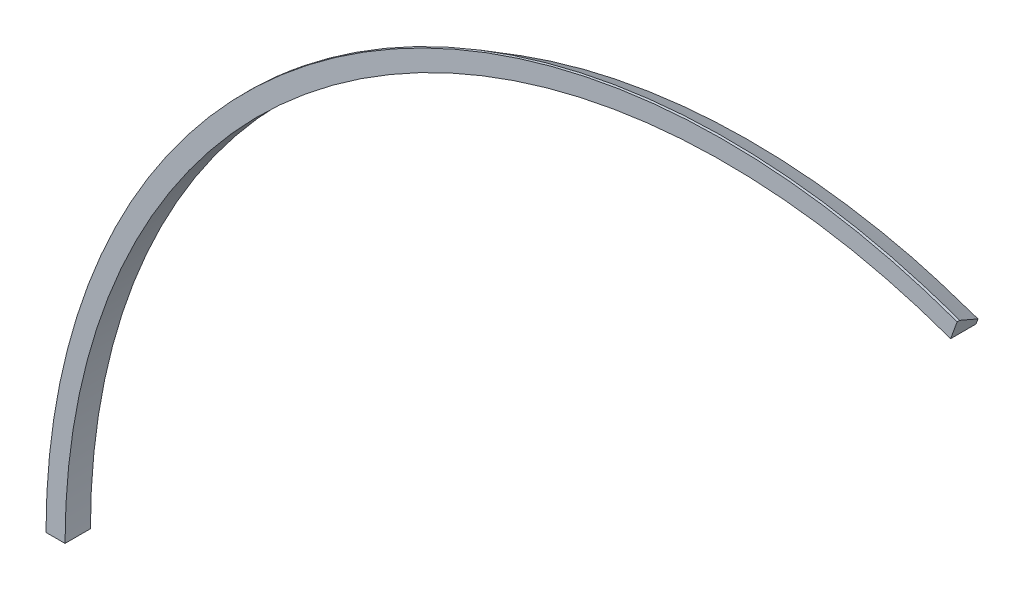
ISO-10303-21;
HEADER;
FILE_DESCRIPTION(('STEP AP214'),'2;1');
FILE_NAME('part.step','',(''),(''),'','','');
FILE_SCHEMA(('AUTOMOTIVE_DESIGN { 1 0 10303 214 1 1 1 1 }'));
ENDSEC;
DATA;
#1=APPLICATION_CONTEXT('core data for automotive mechanical design processes');
#2=APPLICATION_PROTOCOL_DEFINITION('international standard','automotive_design',2000,#1);
#3=PRODUCT_CONTEXT('',#1,'mechanical');
#4=PRODUCT('Part','Part','',(#3));
#5=PRODUCT_RELATED_PRODUCT_CATEGORY('part','',(#4));
#6=PRODUCT_DEFINITION_FORMATION('','',#4);
#7=PRODUCT_DEFINITION_CONTEXT('part definition',#1,'design');
#8=PRODUCT_DEFINITION('design','',#6,#7);
#9=PRODUCT_DEFINITION_SHAPE('','',#8);
#10=(LENGTH_UNIT() NAMED_UNIT(*) SI_UNIT(.MILLI.,.METRE.));
#11=(NAMED_UNIT(*) PLANE_ANGLE_UNIT() SI_UNIT($,.RADIAN.));
#12=(NAMED_UNIT(*) SI_UNIT($,.STERADIAN.) SOLID_ANGLE_UNIT());
#13=UNCERTAINTY_MEASURE_WITH_UNIT(LENGTH_MEASURE(1.E-05),#10,'distance_accuracy_value','');
#14=(GEOMETRIC_REPRESENTATION_CONTEXT(3) GLOBAL_UNCERTAINTY_ASSIGNED_CONTEXT((#13)) GLOBAL_UNIT_ASSIGNED_CONTEXT((#10,
#11,#12)) REPRESENTATION_CONTEXT('',''));
#15=CARTESIAN_POINT('',(0.,0.,0.));
#16=DIRECTION('',(0.,0.,1.));
#17=DIRECTION('',(1.,0.,0.));
#18=AXIS2_PLACEMENT_3D('',#15,#16,#17);
#19=CARTESIAN_POINT('',(17.7850474529351,48.8640162808671,1.));
#20=DIRECTION('',(-0.939692620785906,0.342020143325675,0.));
#21=DIRECTION('',(0.,0.,1.));
#22=AXIS2_PLACEMENT_3D('',#19,#20,#21);
#23=PLANE('',#22);
#24=CARTESIAN_POINT('',(18.2980776679236,50.273555212046,1.8));
#25=CARTESIAN_POINT('',(17.9426399086524,49.2969979944267,0.));
#26=B_SPLINE_CURVE_WITH_KNOTS('',1,(#24,#25),.UNSPECIFIED.,.F.,.F.,(2,2),(0.,1.),.UNSPECIFIED.);
#27=CARTESIAN_POINT('',(17.9426399086524,49.2969979944267,0.));
#28=VERTEX_POINT('',#27);
#29=CARTESIAN_POINT('',(18.2980776679236,50.273555212046,1.8));
#30=VERTEX_POINT('',#29);
#31=EDGE_CURVE('E89',#28,#30,#26,.F.);
#32=ORIENTED_EDGE('',*,*,#31,.T.);
#33=DIRECTION('',(0.,0.,1.));
#34=VECTOR('',#33,1.);
#35=CARTESIAN_POINT('',(18.2980776679236,50.273555212046,-100.30358241769));
#36=LINE('',#35,#34);
#37=CARTESIAN_POINT('',(18.2980776679236,50.273555212046,2.));
#38=VERTEX_POINT('',#37);
#39=EDGE_CURVE('E84',#30,#38,#36,.T.);
#40=ORIENTED_EDGE('',*,*,#39,.T.);
#41=DIRECTION('',(-0.342020143325675,-0.939692620785906,0.));
#42=VECTOR('',#41,1.);
#43=CARTESIAN_POINT('',(17.7850474529351,48.8640162808671,2.));
#44=LINE('',#43,#42);
#45=CARTESIAN_POINT('',(17.7850474529351,48.8640162808671,2.));
#46=VERTEX_POINT('',#45);
#47=EDGE_CURVE('E50',#38,#46,#44,.T.);
#48=ORIENTED_EDGE('',*,*,#47,.T.);
#49=DIRECTION('',(0.,0.,1.));
#50=VECTOR('',#49,1.);
#51=CARTESIAN_POINT('',(17.7850474529351,48.8640162808671,0.));
#52=LINE('',#51,#50);
#53=CARTESIAN_POINT('',(17.7850474529351,48.8640162808671,0.));
#54=VERTEX_POINT('',#53);
#55=EDGE_CURVE('E99',#54,#46,#52,.T.);
#56=ORIENTED_EDGE('',*,*,#55,.F.);
#57=DIRECTION('',(-0.342020143325675,-0.939692620785906,0.));
#58=VECTOR('',#57,1.);
#59=CARTESIAN_POINT('',(17.7850474529351,48.8640162808671,0.));
#60=LINE('',#59,#58);
#61=EDGE_CURVE('E12',#28,#54,#60,.T.);
#62=ORIENTED_EDGE('',*,*,#61,.F.);
#63=EDGE_LOOP('',(#32,#40,#48,#56,#62));
#64=FACE_BOUND('',#63,.T.);
#65=ADVANCED_FACE('F39',(#64),#23,.F.);
#66=CARTESIAN_POINT('',(0.,0.,2.));
#67=DIRECTION('',(0.,0.,-1.));
#68=DIRECTION('',(-1.,0.,0.));
#69=AXIS2_PLACEMENT_3D('',#66,#67,#68);
#70=PLANE('',#69);
#71=ORIENTED_EDGE('',*,*,#47,.F.);
#72=CARTESIAN_POINT('',(0.,0.,2.));
#73=DIRECTION('',(0.,0.,1.));
#74=DIRECTION('',(1.,0.,0.));
#75=AXIS2_PLACEMENT_3D('',#72,#73,#74);
#76=CIRCLE('',#75,53.5);
#77=CARTESIAN_POINT('',(-53.5,0.,2.));
#78=VERTEX_POINT('',#77);
#79=EDGE_CURVE('E124',#38,#78,#76,.T.);
#80=ORIENTED_EDGE('',*,*,#79,.T.);
#81=DIRECTION('',(1.,0.,0.));
#82=VECTOR('',#81,1.);
#83=CARTESIAN_POINT('',(-52.,0.,2.));
#84=LINE('',#83,#82);
#85=CARTESIAN_POINT('',(-52.,0.,2.));
#86=VERTEX_POINT('',#85);
#87=EDGE_CURVE('E105',#78,#86,#84,.T.);
#88=ORIENTED_EDGE('',*,*,#87,.T.);
#89=CARTESIAN_POINT('',(0.,0.,2.));
#90=DIRECTION('',(0.,0.,1.));
#91=DIRECTION('',(1.,0.,0.));
#92=AXIS2_PLACEMENT_3D('',#89,#90,#91);
#93=CIRCLE('',#92,52.);
#94=EDGE_CURVE('E110',#46,#86,#93,.T.);
#95=ORIENTED_EDGE('',*,*,#94,.F.);
#96=EDGE_LOOP('',(#71,#80,#88,#95));
#97=FACE_BOUND('',#96,.T.);
#98=ADVANCED_FACE('F115',(#97),#70,.F.);
#99=CARTESIAN_POINT('',(-52.,0.,1.));
#100=DIRECTION('',(0.,1.,0.));
#101=DIRECTION('',(0.,0.,-1.));
#102=AXIS2_PLACEMENT_3D('',#99,#100,#101);
#103=PLANE('',#102);
#104=CARTESIAN_POINT('',(-52.4607695154587,0.,0.));
#105=CARTESIAN_POINT('',(-53.5,0.,1.8));
#106=B_SPLINE_CURVE_WITH_KNOTS('',1,(#104,#105),.UNSPECIFIED.,.F.,.F.,(2,2),(0.,1.),.UNSPECIFIED.);
#107=CARTESIAN_POINT('',(-53.5,0.,1.8));
#108=VERTEX_POINT('',#107);
#109=CARTESIAN_POINT('',(-52.4607695154587,0.,0.));
#110=VERTEX_POINT('',#109);
#111=EDGE_CURVE('E58',#108,#110,#106,.F.);
#112=ORIENTED_EDGE('',*,*,#111,.T.);
#113=DIRECTION('',(1.,0.,0.));
#114=VECTOR('',#113,1.);
#115=CARTESIAN_POINT('',(-52.,0.,0.));
#116=LINE('',#115,#114);
#117=CARTESIAN_POINT('',(-52.,0.,0.));
#118=VERTEX_POINT('',#117);
#119=EDGE_CURVE('E67',#110,#118,#116,.T.);
#120=ORIENTED_EDGE('',*,*,#119,.T.);
#121=DIRECTION('',(0.,0.,-1.));
#122=VECTOR('',#121,1.);
#123=CARTESIAN_POINT('',(-52.,0.,2.));
#124=LINE('',#123,#122);
#125=EDGE_CURVE('E116',#86,#118,#124,.T.);
#126=ORIENTED_EDGE('',*,*,#125,.F.);
#127=ORIENTED_EDGE('',*,*,#87,.F.);
#128=DIRECTION('',(0.,0.,1.));
#129=VECTOR('',#128,1.);
#130=CARTESIAN_POINT('',(-53.5,0.,-100.30358241769));
#131=LINE('',#130,#129);
#132=EDGE_CURVE('E113',#78,#108,#131,.F.);
#133=ORIENTED_EDGE('',*,*,#132,.T.);
#134=EDGE_LOOP('',(#112,#120,#126,#127,#133));
#135=FACE_BOUND('',#134,.T.);
#136=ADVANCED_FACE('F158',(#135),#103,.F.);
#137=CARTESIAN_POINT('',(0.,0.,0.));
#138=DIRECTION('',(0.,0.,1.));
#139=DIRECTION('',(1.,0.,0.));
#140=AXIS2_PLACEMENT_3D('',#137,#138,#139);
#141=PLANE('',#140);
#142=CARTESIAN_POINT('',(17.9426399086524,49.2969979944267,0.));
#143=CARTESIAN_POINT('',(16.5589593932927,49.7631646422481,0.));
#144=CARTESIAN_POINT('',(14.5700692705899,50.4332284547346,0.));
#145=CARTESIAN_POINT('',(12.5365798661047,50.9500555013803,0.));
#146=CARTESIAN_POINT('',(11.1147337067695,51.280681454,0.));
#147=CARTESIAN_POINT('',(9.05778777589156,51.7024260332133,0.));
#148=CARTESIAN_POINT('',(6.981124361807,52.0088085705395,0.));
#149=CARTESIAN_POINT('',(5.53043307318425,52.1685811612362,0.));
#150=CARTESIAN_POINT('',(3.89713177811879,52.3397625613168,0.));
#151=CARTESIAN_POINT('',(1.80033876775285,52.458542832618,0.));
#152=CARTESIAN_POINT('',(-0.115200804359075,52.4625412489082,0.));
#153=CARTESIAN_POINT('',(-1.57479572320099,52.4466304662912,0.));
#154=CARTESIAN_POINT('',(-3.67208555713806,52.3637192427226,0.));
#155=CARTESIAN_POINT('',(-5.76084031360453,52.154996348362,0.));
#156=CARTESIAN_POINT('',(-7.2080394930673,51.9645133923082,0.));
#157=CARTESIAN_POINT('',(-9.01517960948678,51.7074124139422,0.));
#158=CARTESIAN_POINT('',(-11.0759318300836,51.3036080320494,0.));
#159=CARTESIAN_POINT('',(-12.7576274268488,50.8866359818179,0.));
#160=CARTESIAN_POINT('',(-14.1716146085864,50.5243061235742,0.));
#161=CARTESIAN_POINT('',(-16.1863962841863,49.9345196510626,0.));
#162=CARTESIAN_POINT('',(-18.1617137110599,49.2251369828703,0.));
#163=CARTESIAN_POINT('',(-19.522170897245,48.6961741646161,0.));
#164=CARTESIAN_POINT('',(-21.3822818297632,47.9391697932249,0.));
#165=CARTESIAN_POINT('',(-23.2786931408239,47.0372760537808,0.));
#166=CARTESIAN_POINT('',(-24.6474136069937,46.3103168543904,0.));
#167=CARTESIAN_POINT('',(-25.9347721668476,45.6223105263944,0.));
#168=CARTESIAN_POINT('',(-27.7464696803343,44.5608866108769,0.));
#169=CARTESIAN_POINT('',(-29.4902972631853,43.3933729535896,0.));
#170=CARTESIAN_POINT('',(-30.686052459483,42.556225627837,0.));
#171=CARTESIAN_POINT('',(-32.3796732996219,41.3169980753531,0.));
#172=CARTESIAN_POINT('',(-33.9968156222708,39.9777089274645,0.));
#173=CARTESIAN_POINT('',(-35.0837740383171,39.0034576815028,0.));
#174=CARTESIAN_POINT('',(-36.2369861112654,37.9642975611421,0.));
#175=CARTESIAN_POINT('',(-37.7330983225963,36.4907196237243,0.));
#176=CARTESIAN_POINT('',(-39.0790490234637,35.0036826783005,0.));
#177=CARTESIAN_POINT('',(-40.041576440108,33.9063269715448,0.));
#178=CARTESIAN_POINT('',(-41.3838969331727,32.2928534396594,0.));
#179=CARTESIAN_POINT('',(-42.6273116425663,30.6013908157339,0.));
#180=CARTESIAN_POINT('',(-43.4515863221162,29.3967216572202,0.));
#181=CARTESIAN_POINT('',(-44.4201262589902,27.9570180779605,0.));
#182=CARTESIAN_POINT('',(-45.5044776648759,26.1586557807841,0.));
#183=CARTESIAN_POINT('',(-46.3629338170849,24.5507360839877,0.));
#184=CARTESIAN_POINT('',(-47.0369849343771,23.2560579542115,0.));
#185=CARTESIAN_POINT('',(-47.9475323470768,21.3647165495441,0.));
#186=CARTESIAN_POINT('',(-48.7437981172671,19.4223516420465,0.));
#187=CARTESIAN_POINT('',(-49.2580204629066,18.0562939922479,0.));
#188=CARTESIAN_POINT('',(-49.9097720551665,16.2525459176842,0.));
#189=CARTESIAN_POINT('',(-50.5111089225222,14.2414692903402,0.));
#190=CARTESIAN_POINT('',(-50.9138076706366,12.6507595919397,0.));
#191=CARTESIAN_POINT('',(-51.265233655213,11.2330974730855,0.));
#192=CARTESIAN_POINT('',(-51.6988017012093,9.17720035944776,0.));
#193=CARTESIAN_POINT('',(-51.9640194388238,7.09897344543595,0.));
#194=CARTESIAN_POINT('',(-52.2670346569937,4.20111342877182,0.));
#195=CARTESIAN_POINT('',(-52.3639020862262,2.10055671438591,0.));
#196=CARTESIAN_POINT('',(-52.4607695154587,0.,0.));
#197=B_SPLINE_CURVE_WITH_KNOTS('',3,(#142,#143,#144,#145,#146,#147,#148,#149,#150,#151,#152,
#153,#154,#155,#156,#157,#158,#159,#160,#161,#162,#163,#164,#165,#166,#167,#168,#169,#170,#171,
#172,#173,#174,#175,#176,#177,#178,#179,#180,#181,#182,#183,#184,#185,#186,#187,#188,#189,#190,
#191,#192,#193,#194,#195,#196),.UNSPECIFIED.,.F.,.F.,(4,1,2,1,2,1,1,2,1,2,1,1,2,1,2,1,1,2,1,2,1,
2,1,1,2,1,2,1,1,2,1,2,1,1,2,1,2,4),(0.,0.0434815534668469,0.0624999999999999,0.0869631069336936,
0.125,0.130444660400541,0.173926213867387,0.1875,0.217407767334235,0.25,0.260889320801081,
0.304370874267928,0.3125,0.347852427734775,0.375,0.391333981201622,0.434815534668469,
0.437499999999999,0.478297088135316,0.499999999999999,0.521778641602163,0.562499999999999,
0.56526019506901,0.608741748535857,0.625,0.652223302002704,0.6875,0.695704855469551,
0.739186408936398,0.75,0.782667962403244,0.8125,0.826149515870091,0.869631069336938,0.875,
0.913112622803785,0.9375,1.),.UNSPECIFIED.);
#198=EDGE_CURVE('E145',#110,#28,#197,.F.);
#199=ORIENTED_EDGE('',*,*,#198,.T.);
#200=ORIENTED_EDGE('',*,*,#61,.T.);
#201=CARTESIAN_POINT('',(0.,0.,0.));
#202=DIRECTION('',(0.,0.,-1.));
#203=DIRECTION('',(-1.,0.,0.));
#204=AXIS2_PLACEMENT_3D('',#201,#202,#203);
#205=CIRCLE('',#204,52.);
#206=EDGE_CURVE('E112',#118,#54,#205,.T.);
#207=ORIENTED_EDGE('',*,*,#206,.F.);
#208=ORIENTED_EDGE('',*,*,#119,.F.);
#209=EDGE_LOOP('',(#199,#200,#207,#208));
#210=FACE_BOUND('',#209,.T.);
#211=ADVANCED_FACE('F41',(#210),#141,.F.);
#212=CARTESIAN_POINT('',(0.,0.,-100.30358241769));
#213=DIRECTION('',(0.,0.,1.));
#214=DIRECTION('',(1.,0.,0.));
#215=AXIS2_PLACEMENT_3D('',#212,#213,#214);
#216=CYLINDRICAL_SURFACE('',#215,52.);
#217=ORIENTED_EDGE('',*,*,#125,.T.);
#218=ORIENTED_EDGE('',*,*,#206,.T.);
#219=ORIENTED_EDGE('',*,*,#55,.T.);
#220=ORIENTED_EDGE('',*,*,#94,.T.);
#221=EDGE_LOOP('',(#217,#218,#219,#220));
#222=FACE_BOUND('',#221,.T.);
#223=ADVANCED_FACE('F109',(#222),#216,.F.);
#224=CARTESIAN_POINT('',(0.,0.,-100.30358241769));
#225=DIRECTION('',(0.,0.,1.));
#226=DIRECTION('',(1.,0.,0.));
#227=AXIS2_PLACEMENT_3D('',#224,#225,#226);
#228=CYLINDRICAL_SURFACE('',#227,53.5);
#229=ORIENTED_EDGE('',*,*,#39,.F.);
#230=CARTESIAN_POINT('',(-53.5,0.,1.8));
#231=CARTESIAN_POINT('',(-53.5,1.82602643206088,1.8));
#232=CARTESIAN_POINT('',(-53.4064265042749,3.70107850063627,1.8));
#233=CARTESIAN_POINT('',(-53.126106958243,6.35839952784529,1.8));
#234=CARTESIAN_POINT('',(-52.8822629010972,8.28407996791789,1.8));
#235=CARTESIAN_POINT('',(-52.5253257092785,10.2395465001078,1.8));
#236=CARTESIAN_POINT('',(-52.2257535804778,11.6082122373175,1.8));
#237=CARTESIAN_POINT('',(-51.8810736205298,13.1471770658974,1.8));
#238=CARTESIAN_POINT('',(-51.3449606559233,15.1298807388262,1.8));
#239=CARTESIAN_POINT('',(-50.747804020258,16.9446293252695,1.8));
#240=CARTESIAN_POINT('',(-50.2735349825328,18.3255329380612,1.8));
#241=CARTESIAN_POINT('',(-49.5296308766525,20.3095391973668,1.8));
#242=CARTESIAN_POINT('',(-48.653311163346,22.2799477644959,1.8));
#243=CARTESIAN_POINT('',(-47.9946578679863,23.6411557670658,1.8));
#244=CARTESIAN_POINT('',(-47.1519399264787,25.3368963089593,1.8));
#245=CARTESIAN_POINT('',(-46.0650262564705,27.2618315657149,1.8));
#246=CARTESIAN_POINT('',(-45.0750025474865,28.8197897880487,1.8));
#247=CARTESIAN_POINT('',(-44.2299843924284,30.1255837517264,1.8));
#248=CARTESIAN_POINT('',(-42.9402357879407,31.9724697328568,1.8));
#249=CARTESIAN_POINT('',(-41.522275365957,33.7511306357209,1.8));
#250=CARTESIAN_POINT('',(-40.4980851944298,34.9643753845755,1.8));
#251=CARTESIAN_POINT('',(-39.0600052394781,36.6113890127378,1.8));
#252=CARTESIAN_POINT('',(-37.4404471016615,38.2520499079913,1.8));
#253=CARTESIAN_POINT('',(-36.1822516822643,39.4094541998119,1.8));
#254=CARTESIAN_POINT('',(-34.9958157308141,40.4945700261832,1.8));
#255=CARTESIAN_POINT('',(-33.2196112877588,41.9863072146744,1.8));
#256=CARTESIAN_POINT('',(-31.348806730172,43.3607697123922,1.8));
#257=CARTESIAN_POINT('',(-30.0261755227661,44.2868860540892,1.8));
#258=CARTESIAN_POINT('',(-28.0948557276352,45.5749240102523,1.8));
#259=CARTESIAN_POINT('',(-26.0856573793791,46.7339730848347,1.8));
#260=CARTESIAN_POINT('',(-24.6601970504782,47.4777267229871,1.8));
#261=CARTESIAN_POINT('',(-23.1448048605895,48.2630235233421,1.8));
#262=CARTESIAN_POINT('',(-21.0492868792486,49.2241114647696,1.8));
#263=CARTESIAN_POINT('',(-19.0072003440565,50.0133189915747,1.8));
#264=CARTESIAN_POINT('',(-17.5168295370921,50.560788795148,1.8));
#265=CARTESIAN_POINT('',(-15.3605032633275,51.2850726335665,1.8));
#266=CARTESIAN_POINT('',(-13.1838835930418,51.86554128746,1.8));
#267=CARTESIAN_POINT('',(-11.6678254106013,52.2129907735875,1.8));
#268=CARTESIAN_POINT('',(-9.86786103964535,52.6100165867841,1.8));
#269=CARTESIAN_POINT('',(-7.6872482206923,52.9733531143813,1.8));
#270=CARTESIAN_POINT('',(-5.80289998190861,53.1857102004599,1.8));
#271=CARTESIAN_POINT('',(-4.29851017205816,53.3390812856307,1.8));
#272=CARTESIAN_POINT('',(-2.14718705784677,53.4887973968335,1.8));
#273=CARTESIAN_POINT('',(-0.0283489574242254,53.5094176256389,1.8));
#274=CARTESIAN_POINT('',(1.43148554179045,53.4827878890906,1.8));
#275=CARTESIAN_POINT('',(3.33854720018464,53.4234659341655,1.8));
#276=CARTESIAN_POINT('',(5.38516739634792,53.2493988165416,1.8));
#277=CARTESIAN_POINT('',(6.95168991338207,53.0467226696322,1.8));
#278=CARTESIAN_POINT('',(8.34027470938939,52.8601171368539,1.8));
#279=CARTESIAN_POINT('',(10.2999640617787,52.5268489362786,1.8));
#280=CARTESIAN_POINT('',(12.1929976322688,52.097473956133,1.8));
#281=CARTESIAN_POINT('',(13.4905975618879,51.7744711219961,1.8));
#282=CARTESIAN_POINT('',(15.3340958641981,51.2830788850235,1.8));
#283=CARTESIAN_POINT('',(17.1043152272321,50.7080492072427,1.8));
#284=CARTESIAN_POINT('',(18.2980776679236,50.273555212046,1.8));
#285=B_SPLINE_CURVE_WITH_KNOTS('',3,(#230,#231,#232,#233,#234,#235,#236,#237,#238,#239,#240,
#241,#242,#243,#244,#245,#246,#247,#248,#249,#250,#251,#252,#253,#254,#255,#256,#257,#258,#259,
#260,#261,#262,#263,#264,#265,#266,#267,#268,#269,#270,#271,#272,#273,#274,#275,#276,#277,#278,
#279,#280,#281,#282,#283,#284),.UNSPECIFIED.,.F.,.F.,(4,2,1,2,1,1,2,1,2,1,1,2,1,2,1,1,2,1,2,1,2,
1,1,2,1,2,1,1,2,1,2,1,1,2,1,2,1,4),(0.,0.0625,0.0868873771962148,0.125,0.130368930663062,
0.173850484129909,0.1875,0.217332037596756,0.25,0.260813591063602,0.304295144530449,0.3125,
0.347776697997296,0.375,0.391258251464143,0.43473980493099,0.437500000000001,0.478221358397837,
0.500000000000001,0.521702911864684,0.562500000000001,0.565184465331531,0.608666018798378,0.625,
0.652147572265225,0.6875,0.695629125732072,0.739110679198919,0.75,0.782592232665765,0.8125,
0.826073786132613,0.869555339599459,0.875,0.913036893066306,0.9375,0.956518446533153,1.),.UNSPECIFIED.);
#286=EDGE_CURVE('E133',#30,#108,#285,.F.);
#287=ORIENTED_EDGE('',*,*,#286,.T.);
#288=ORIENTED_EDGE('',*,*,#132,.F.);
#289=ORIENTED_EDGE('',*,*,#79,.F.);
#290=EDGE_LOOP('',(#229,#287,#288,#289));
#291=FACE_BOUND('',#290,.T.);
#292=ADVANCED_FACE('F167',(#291),#228,.T.);
#293=CARTESIAN_POINT('',(18.2980776679236,50.273555212046,1.8));
#294=CARTESIAN_POINT('',(17.9426399086524,49.2969979944267,0.));
#295=CARTESIAN_POINT('',(17.1043152272321,50.7080492072427,1.8));
#296=CARTESIAN_POINT('',(16.5589593932927,49.7631646422481,0.));
#297=CARTESIAN_POINT('',(15.3340958641981,51.2830788850235,1.8));
#298=CARTESIAN_POINT('',(14.5700692705899,50.4332284547346,0.));
#299=CARTESIAN_POINT('',(13.4905975618879,51.7744711219961,1.8));
#300=CARTESIAN_POINT('',(12.5365798661047,50.9500555013803,0.));
#301=CARTESIAN_POINT('',(12.1929976322688,52.097473956133,1.8));
#302=CARTESIAN_POINT('',(11.1147337067695,51.280681454,0.));
#303=CARTESIAN_POINT('',(10.2999640617787,52.5268489362786,1.8));
#304=CARTESIAN_POINT('',(9.05778777589156,51.7024260332133,0.));
#305=CARTESIAN_POINT('',(8.34027470938939,52.8601171368539,1.8));
#306=CARTESIAN_POINT('',(6.981124361807,52.0088085705395,0.));
#307=CARTESIAN_POINT('',(6.95168991338207,53.0467226696322,1.8));
#308=CARTESIAN_POINT('',(5.53043307318425,52.1685811612362,0.));
#309=CARTESIAN_POINT('',(5.38516739634792,53.2493988165416,1.8));
#310=CARTESIAN_POINT('',(3.89713177811879,52.3397625613168,0.));
#311=CARTESIAN_POINT('',(3.33854720018464,53.4234659341655,1.8));
#312=CARTESIAN_POINT('',(1.80033876775285,52.458542832618,0.));
#313=CARTESIAN_POINT('',(1.43148554179045,53.4827878890906,1.8));
#314=CARTESIAN_POINT('',(-0.115200804359075,52.4625412489082,0.));
#315=CARTESIAN_POINT('',(-0.0283489574242254,53.5094176256389,1.8));
#316=CARTESIAN_POINT('',(-1.57479572320099,52.4466304662912,0.));
#317=CARTESIAN_POINT('',(-2.14718705784677,53.4887973968335,1.8));
#318=CARTESIAN_POINT('',(-3.67208555713806,52.3637192427226,0.));
#319=CARTESIAN_POINT('',(-4.29851017205816,53.3390812856307,1.8));
#320=CARTESIAN_POINT('',(-5.76084031360453,52.154996348362,0.));
#321=CARTESIAN_POINT('',(-5.80289998190861,53.1857102004599,1.8));
#322=CARTESIAN_POINT('',(-7.2080394930673,51.9645133923082,0.));
#323=CARTESIAN_POINT('',(-7.6872482206923,52.9733531143813,1.8));
#324=CARTESIAN_POINT('',(-9.01517960948678,51.7074124139422,0.));
#325=CARTESIAN_POINT('',(-9.86786103964535,52.6100165867841,1.8));
#326=CARTESIAN_POINT('',(-11.0759318300836,51.3036080320494,0.));
#327=CARTESIAN_POINT('',(-11.6678254106013,52.2129907735875,1.8));
#328=CARTESIAN_POINT('',(-12.7576274268488,50.8866359818179,0.));
#329=CARTESIAN_POINT('',(-13.1838835930418,51.86554128746,1.8));
#330=CARTESIAN_POINT('',(-14.1716146085864,50.5243061235742,0.));
#331=CARTESIAN_POINT('',(-15.3605032633275,51.2850726335665,1.8));
#332=CARTESIAN_POINT('',(-16.1863962841863,49.9345196510626,0.));
#333=CARTESIAN_POINT('',(-17.5168295370921,50.560788795148,1.8));
#334=CARTESIAN_POINT('',(-18.1617137110599,49.2251369828703,0.));
#335=CARTESIAN_POINT('',(-19.0072003440565,50.0133189915747,1.8));
#336=CARTESIAN_POINT('',(-19.522170897245,48.6961741646161,0.));
#337=CARTESIAN_POINT('',(-21.0492868792486,49.2241114647696,1.8));
#338=CARTESIAN_POINT('',(-21.3822818297632,47.9391697932249,0.));
#339=CARTESIAN_POINT('',(-23.1448048605895,48.2630235233421,1.8));
#340=CARTESIAN_POINT('',(-23.2786931408239,47.0372760537808,0.));
#341=CARTESIAN_POINT('',(-24.6601970504782,47.4777267229871,1.8));
#342=CARTESIAN_POINT('',(-24.6474136069937,46.3103168543904,0.));
#343=CARTESIAN_POINT('',(-26.0856573793791,46.7339730848347,1.8));
#344=CARTESIAN_POINT('',(-25.9347721668476,45.6223105263944,0.));
#345=CARTESIAN_POINT('',(-28.0948557276352,45.5749240102523,1.8));
#346=CARTESIAN_POINT('',(-27.7464696803343,44.5608866108769,0.));
#347=CARTESIAN_POINT('',(-30.0261755227661,44.2868860540892,1.8));
#348=CARTESIAN_POINT('',(-29.4902972631853,43.3933729535896,0.));
#349=CARTESIAN_POINT('',(-31.348806730172,43.3607697123922,1.8));
#350=CARTESIAN_POINT('',(-30.686052459483,42.556225627837,0.));
#351=CARTESIAN_POINT('',(-33.2196112877588,41.9863072146744,1.8));
#352=CARTESIAN_POINT('',(-32.3796732996219,41.3169980753531,0.));
#353=CARTESIAN_POINT('',(-34.9958157308141,40.4945700261832,1.8));
#354=CARTESIAN_POINT('',(-33.9968156222708,39.9777089274645,0.));
#355=CARTESIAN_POINT('',(-36.1822516822643,39.4094541998119,1.8));
#356=CARTESIAN_POINT('',(-35.0837740383171,39.0034576815028,0.));
#357=CARTESIAN_POINT('',(-37.4404471016615,38.2520499079913,1.8));
#358=CARTESIAN_POINT('',(-36.2369861112654,37.9642975611421,0.));
#359=CARTESIAN_POINT('',(-39.0600052394781,36.6113890127378,1.8));
#360=CARTESIAN_POINT('',(-37.7330983225963,36.4907196237243,0.));
#361=CARTESIAN_POINT('',(-40.4980851944298,34.9643753845755,1.8));
#362=CARTESIAN_POINT('',(-39.0790490234637,35.0036826783005,0.));
#363=CARTESIAN_POINT('',(-41.522275365957,33.7511306357209,1.8));
#364=CARTESIAN_POINT('',(-40.041576440108,33.9063269715448,0.));
#365=CARTESIAN_POINT('',(-42.9402357879407,31.9724697328568,1.8));
#366=CARTESIAN_POINT('',(-41.3838969331727,32.2928534396594,0.));
#367=CARTESIAN_POINT('',(-44.2299843924284,30.1255837517264,1.8));
#368=CARTESIAN_POINT('',(-42.6273116425663,30.6013908157339,0.));
#369=CARTESIAN_POINT('',(-45.0750025474865,28.8197897880487,1.8));
#370=CARTESIAN_POINT('',(-43.4515863221162,29.3967216572202,0.));
#371=CARTESIAN_POINT('',(-46.0650262564705,27.2618315657149,1.8));
#372=CARTESIAN_POINT('',(-44.4201262589902,27.9570180779605,0.));
#373=CARTESIAN_POINT('',(-47.1519399264787,25.3368963089593,1.8));
#374=CARTESIAN_POINT('',(-45.5044776648759,26.1586557807841,0.));
#375=CARTESIAN_POINT('',(-47.9946578679863,23.6411557670658,1.8));
#376=CARTESIAN_POINT('',(-46.3629338170849,24.5507360839877,0.));
#377=CARTESIAN_POINT('',(-48.653311163346,22.2799477644959,1.8));
#378=CARTESIAN_POINT('',(-47.0369849343771,23.2560579542115,0.));
#379=CARTESIAN_POINT('',(-49.5296308766525,20.3095391973668,1.8));
#380=CARTESIAN_POINT('',(-47.9475323470768,21.3647165495441,0.));
#381=CARTESIAN_POINT('',(-50.2735349825328,18.3255329380612,1.8));
#382=CARTESIAN_POINT('',(-48.7437981172671,19.4223516420465,0.));
#383=CARTESIAN_POINT('',(-50.747804020258,16.9446293252695,1.8));
#384=CARTESIAN_POINT('',(-49.2580204629066,18.0562939922479,0.));
#385=CARTESIAN_POINT('',(-51.3449606559233,15.1298807388262,1.8));
#386=CARTESIAN_POINT('',(-49.9097720551665,16.2525459176842,0.));
#387=CARTESIAN_POINT('',(-51.8810736205298,13.1471770658974,1.8));
#388=CARTESIAN_POINT('',(-50.5111089225222,14.2414692903402,0.));
#389=CARTESIAN_POINT('',(-52.2257535804778,11.6082122373175,1.8));
#390=CARTESIAN_POINT('',(-50.9138076706366,12.6507595919397,0.));
#391=CARTESIAN_POINT('',(-52.5253257092785,10.2395465001078,1.8));
#392=CARTESIAN_POINT('',(-51.265233655213,11.2330974730855,0.));
#393=CARTESIAN_POINT('',(-52.8822629010972,8.28407996791789,1.8));
#394=CARTESIAN_POINT('',(-51.6988017012093,9.17720035944776,0.));
#395=CARTESIAN_POINT('',(-53.126106958243,6.35839952784529,1.8));
#396=CARTESIAN_POINT('',(-51.9640194388238,7.09897344543595,0.));
#397=CARTESIAN_POINT('',(-53.4064265042749,3.70107850063627,1.8));
#398=CARTESIAN_POINT('',(-52.2670346569937,4.20111342877182,0.));
#399=CARTESIAN_POINT('',(-53.5,1.82602643206088,1.8));
#400=CARTESIAN_POINT('',(-52.3639020862262,2.10055671438591,0.));
#401=CARTESIAN_POINT('',(-53.5,0.,1.8));
#402=CARTESIAN_POINT('',(-52.4607695154587,0.,0.));
#403=B_SPLINE_SURFACE_WITH_KNOTS('',3,1,((#293,#294),(#295,#296),(#297,#298),(#299,#300),(#301,
#302),(#303,#304),(#305,#306),(#307,#308),(#309,#310),(#311,#312),(#313,#314),(#315,#316),(#317,
#318),(#319,#320),(#321,#322),(#323,#324),(#325,#326),(#327,#328),(#329,#330),(#331,#332),(#333,
#334),(#335,#336),(#337,#338),(#339,#340),(#341,#342),(#343,#344),(#345,#346),(#347,#348),(#349,
#350),(#351,#352),(#353,#354),(#355,#356),(#357,#358),(#359,#360),(#361,#362),(#363,#364),(#365,
#366),(#367,#368),(#369,#370),(#371,#372),(#373,#374),(#375,#376),(#377,#378),(#379,#380),(#381,
#382),(#383,#384),(#385,#386),(#387,#388),(#389,#390),(#391,#392),(#393,#394),(#395,#396),(#397,
#398),(#399,#400),(#401,#402)),.UNSPECIFIED.,.F.,.F.,.F.,(4,1,2,1,2,1,1,2,1,2,1,1,2,1,2,1,1,2,1,
2,1,2,1,1,2,1,2,1,1,2,1,2,1,1,2,1,2,4),(2,2),(0.,0.0434815534668469,0.0624999999999999,
0.0869631069336936,0.125,0.130444660400541,0.173926213867387,0.1875,0.217407767334235,0.25,
0.260889320801081,0.304370874267928,0.3125,0.347852427734775,0.375,0.391333981201622,
0.434815534668469,0.437499999999999,0.478297088135316,0.499999999999999,0.521778641602163,
0.562499999999999,0.56526019506901,0.608741748535857,0.625,0.652223302002704,0.6875,
0.695704855469551,0.739186408936398,0.75,0.782667962403244,0.8125,0.826149515870091,
0.869631069336938,0.875,0.913112622803785,0.9375,1.),(0.,1.),.UNSPECIFIED.);
#404=ORIENTED_EDGE('',*,*,#286,.F.);
#405=ORIENTED_EDGE('',*,*,#31,.F.);
#406=ORIENTED_EDGE('',*,*,#198,.F.);
#407=ORIENTED_EDGE('',*,*,#111,.F.);
#408=EDGE_LOOP('',(#404,#405,#406,#407));
#409=FACE_BOUND('',#408,.T.);
#410=ADVANCED_FACE('F199',(#409),#403,.F.);
#411=CLOSED_SHELL('',(#65,#98,#136,#211,#223,#292,#410));
#412=MANIFOLD_SOLID_BREP('B2',#411);
#413=ADVANCED_BREP_SHAPE_REPRESENTATION('',(#18,#412),#14);
#414=SHAPE_DEFINITION_REPRESENTATION(#9,#413);
ENDSEC;
END-ISO-10303-21;
